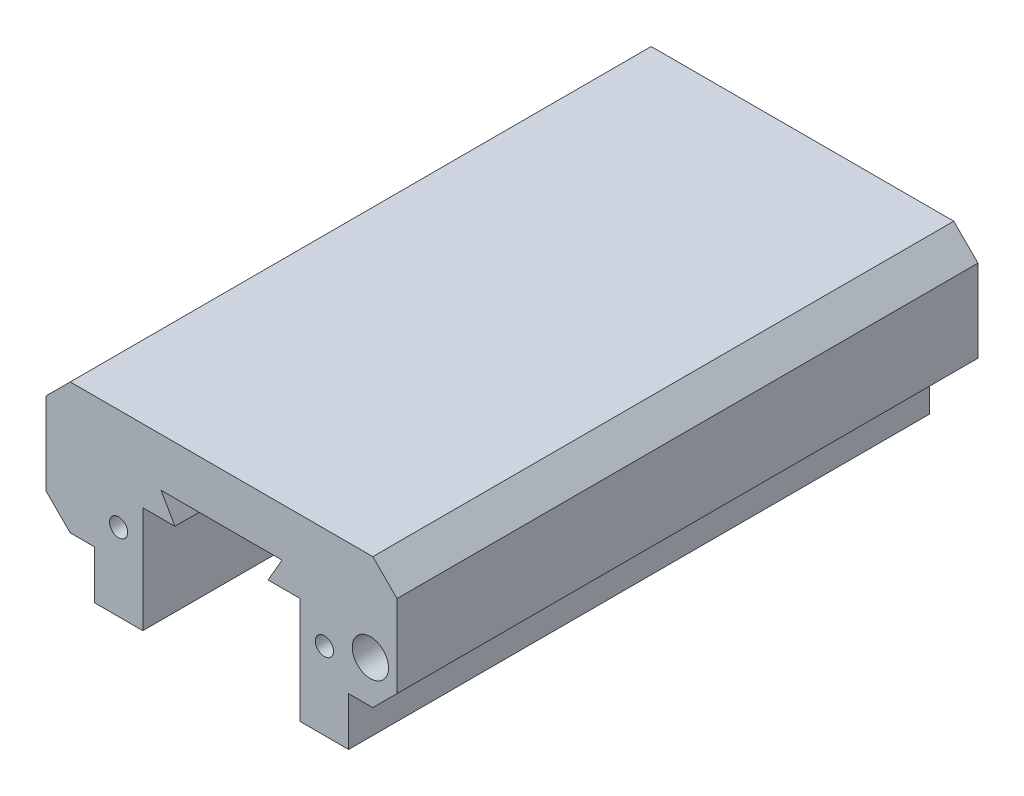
ISO-10303-21;
HEADER;
FILE_DESCRIPTION(('STEP AP214'),'2;1');
FILE_NAME('part.step','',(''),(''),'','','');
FILE_SCHEMA(('AUTOMOTIVE_DESIGN { 1 0 10303 214 1 1 1 1 }'));
ENDSEC;
DATA;
#1=APPLICATION_CONTEXT('core data for automotive mechanical design processes');
#2=APPLICATION_PROTOCOL_DEFINITION('international standard','automotive_design',2000,#1);
#3=PRODUCT_CONTEXT('',#1,'mechanical');
#4=PRODUCT('Part','Part','',(#3));
#5=PRODUCT_RELATED_PRODUCT_CATEGORY('part','',(#4));
#6=PRODUCT_DEFINITION_FORMATION('','',#4);
#7=PRODUCT_DEFINITION_CONTEXT('part definition',#1,'design');
#8=PRODUCT_DEFINITION('design','',#6,#7);
#9=PRODUCT_DEFINITION_SHAPE('','',#8);
#10=(LENGTH_UNIT() NAMED_UNIT(*) SI_UNIT(.MILLI.,.METRE.));
#11=(NAMED_UNIT(*) PLANE_ANGLE_UNIT() SI_UNIT($,.RADIAN.));
#12=(NAMED_UNIT(*) SI_UNIT($,.STERADIAN.) SOLID_ANGLE_UNIT());
#13=UNCERTAINTY_MEASURE_WITH_UNIT(LENGTH_MEASURE(1.E-05),#10,'distance_accuracy_value','');
#14=(GEOMETRIC_REPRESENTATION_CONTEXT(3) GLOBAL_UNCERTAINTY_ASSIGNED_CONTEXT((#13)) GLOBAL_UNIT_ASSIGNED_CONTEXT((#10,
#11,#12)) REPRESENTATION_CONTEXT('',''));
#15=CARTESIAN_POINT('',(0.,0.,0.));
#16=DIRECTION('',(0.,0.,1.));
#17=DIRECTION('',(1.,0.,0.));
#18=AXIS2_PLACEMENT_3D('',#15,#16,#17);
#19=CARTESIAN_POINT('',(0.,0.,6.05));
#20=DIRECTION('',(0.,0.,1.));
#21=DIRECTION('',(1.,0.,0.));
#22=AXIS2_PLACEMENT_3D('',#19,#20,#21);
#23=PLANE('',#22);
#24=CARTESIAN_POINT('',(2.125,-0.6,6.05));
#25=DIRECTION('',(0.,0.,1.));
#26=DIRECTION('',(1.,0.,0.));
#27=AXIS2_PLACEMENT_3D('',#24,#25,#26);
#28=CIRCLE('',#27,0.1875);
#29=CARTESIAN_POINT('',(2.3125,-0.6,6.05));
#30=VERTEX_POINT('',#29);
#31=EDGE_CURVE('E309',#30,#30,#28,.T.);
#32=ORIENTED_EDGE('',*,*,#31,.F.);
#33=EDGE_LOOP('',(#32));
#34=FACE_BOUND('',#33,.T.);
#35=CARTESIAN_POINT('',(-2.125,-0.6,6.05));
#36=DIRECTION('',(0.,0.,1.));
#37=DIRECTION('',(1.,0.,0.));
#38=AXIS2_PLACEMENT_3D('',#35,#36,#37);
#39=CIRCLE('',#38,0.1875);
#40=CARTESIAN_POINT('',(-1.9375,-0.6,6.05));
#41=VERTEX_POINT('',#40);
#42=EDGE_CURVE('E315',#41,#41,#39,.T.);
#43=ORIENTED_EDGE('',*,*,#42,.F.);
#44=EDGE_LOOP('',(#43));
#45=FACE_BOUND('',#44,.T.);
#46=CARTESIAN_POINT('',(3.075,-0.3315,6.05));
#47=DIRECTION('',(0.,0.,1.));
#48=DIRECTION('',(1.,0.,0.));
#49=AXIS2_PLACEMENT_3D('',#46,#47,#48);
#50=CIRCLE('',#49,0.375000000000001);
#51=CARTESIAN_POINT('',(3.45,-0.3315,6.05));
#52=VERTEX_POINT('',#51);
#53=EDGE_CURVE('E324',#52,#52,#50,.T.);
#54=ORIENTED_EDGE('',*,*,#53,.F.);
#55=EDGE_LOOP('',(#54));
#56=FACE_BOUND('',#55,.T.);
#57=DIRECTION('',(-1.,0.,0.));
#58=VECTOR('',#57,1.);
#59=CARTESIAN_POINT('',(0.,-1.2,6.05));
#60=LINE('',#59,#58);
#61=CARTESIAN_POINT('',(3.125,-1.2,6.05));
#62=VERTEX_POINT('',#61);
#63=CARTESIAN_POINT('',(2.625,-1.2,6.05));
#64=VERTEX_POINT('',#63);
#65=EDGE_CURVE('E351',#62,#64,#60,.T.);
#66=ORIENTED_EDGE('',*,*,#65,.F.);
#67=DIRECTION('',(-0.707106781186545,-0.70710678118655,0.));
#68=VECTOR('',#67,1.);
#69=CARTESIAN_POINT('',(2.16250000000001,-2.1625,6.05));
#70=LINE('',#69,#68);
#71=CARTESIAN_POINT('',(3.625,-0.7,6.05));
#72=VERTEX_POINT('',#71);
#73=EDGE_CURVE('E446',#62,#72,#70,.F.);
#74=ORIENTED_EDGE('',*,*,#73,.T.);
#75=DIRECTION('',(0.,-1.,0.));
#76=VECTOR('',#75,1.);
#77=CARTESIAN_POINT('',(3.625,0.,6.05));
#78=LINE('',#77,#76);
#79=CARTESIAN_POINT('',(3.625,1.,6.05));
#80=VERTEX_POINT('',#79);
#81=EDGE_CURVE('E353',#80,#72,#78,.T.);
#82=ORIENTED_EDGE('',*,*,#81,.F.);
#83=DIRECTION('',(0.707106781186549,-0.707106781186546,0.));
#84=VECTOR('',#83,1.);
#85=CARTESIAN_POINT('',(2.31249999999999,2.3125,6.05));
#86=LINE('',#85,#84);
#87=CARTESIAN_POINT('',(3.125,1.5,6.05));
#88=VERTEX_POINT('',#87);
#89=EDGE_CURVE('E440',#80,#88,#86,.F.);
#90=ORIENTED_EDGE('',*,*,#89,.T.);
#91=DIRECTION('',(1.,0.,0.));
#92=VECTOR('',#91,1.);
#93=CARTESIAN_POINT('',(0.,1.5,6.05));
#94=LINE('',#93,#92);
#95=CARTESIAN_POINT('',(-3.125,1.5,6.05));
#96=VERTEX_POINT('',#95);
#97=EDGE_CURVE('E356',#96,#88,#94,.T.);
#98=ORIENTED_EDGE('',*,*,#97,.F.);
#99=DIRECTION('',(-0.707106781186545,-0.70710678118655,0.));
#100=VECTOR('',#99,1.);
#101=CARTESIAN_POINT('',(-2.31250000000001,2.3125,6.05));
#102=LINE('',#101,#100);
#103=CARTESIAN_POINT('',(-3.625,1.,6.05));
#104=VERTEX_POINT('',#103);
#105=EDGE_CURVE('E442',#96,#104,#102,.T.);
#106=ORIENTED_EDGE('',*,*,#105,.T.);
#107=DIRECTION('',(0.,-1.,0.));
#108=VECTOR('',#107,1.);
#109=CARTESIAN_POINT('',(-3.625,0.,6.05));
#110=LINE('',#109,#108);
#111=CARTESIAN_POINT('',(-3.625,-0.700000000000002,6.05));
#112=VERTEX_POINT('',#111);
#113=EDGE_CURVE('E358',#104,#112,#110,.T.);
#114=ORIENTED_EDGE('',*,*,#113,.T.);
#115=DIRECTION('',(-0.707106781186549,0.707106781186546,0.));
#116=VECTOR('',#115,1.);
#117=CARTESIAN_POINT('',(-2.16249999999999,-2.1625,6.05));
#118=LINE('',#117,#116);
#119=CARTESIAN_POINT('',(-3.125,-1.2,6.05));
#120=VERTEX_POINT('',#119);
#121=EDGE_CURVE('E444',#112,#120,#118,.F.);
#122=ORIENTED_EDGE('',*,*,#121,.T.);
#123=DIRECTION('',(1.,0.,0.));
#124=VECTOR('',#123,1.);
#125=CARTESIAN_POINT('',(0.,-1.2,6.05));
#126=LINE('',#125,#124);
#127=CARTESIAN_POINT('',(-2.625,-1.2,6.05));
#128=VERTEX_POINT('',#127);
#129=EDGE_CURVE('E361',#120,#128,#126,.T.);
#130=ORIENTED_EDGE('',*,*,#129,.T.);
#131=DIRECTION('',(0.,-1.,0.));
#132=VECTOR('',#131,1.);
#133=CARTESIAN_POINT('',(-2.625,0.,6.05));
#134=LINE('',#133,#132);
#135=CARTESIAN_POINT('',(-2.625,-2.2,6.05));
#136=VERTEX_POINT('',#135);
#137=EDGE_CURVE('E363',#128,#136,#134,.T.);
#138=ORIENTED_EDGE('',*,*,#137,.T.);
#139=DIRECTION('',(-1.,0.,0.));
#140=VECTOR('',#139,1.);
#141=CARTESIAN_POINT('',(0.,-2.2,6.05));
#142=LINE('',#141,#140);
#143=CARTESIAN_POINT('',(-1.625,-2.2,6.05));
#144=VERTEX_POINT('',#143);
#145=EDGE_CURVE('E366',#144,#136,#142,.T.);
#146=ORIENTED_EDGE('',*,*,#145,.F.);
#147=DIRECTION('',(0.,-1.,0.));
#148=VECTOR('',#147,1.);
#149=CARTESIAN_POINT('',(-1.625,0.,6.05));
#150=LINE('',#149,#148);
#151=CARTESIAN_POINT('',(-1.625,0.,6.05));
#152=VERTEX_POINT('',#151);
#153=EDGE_CURVE('E369',#152,#144,#150,.T.);
#154=ORIENTED_EDGE('',*,*,#153,.F.);
#155=DIRECTION('',(1.,0.,0.));
#156=VECTOR('',#155,1.);
#157=CARTESIAN_POINT('',(0.,0.,6.05));
#158=LINE('',#157,#156);
#159=CARTESIAN_POINT('',(-0.961324865405191,0.,6.05));
#160=VERTEX_POINT('',#159);
#161=EDGE_CURVE('E327',#152,#160,#158,.T.);
#162=ORIENTED_EDGE('',*,*,#161,.T.);
#163=DIRECTION('',(0.5,-0.866025403784439,0.));
#164=VECTOR('',#163,1.);
#165=CARTESIAN_POINT('',(-0.720993649053893,-0.416265877365276,6.05));
#166=LINE('',#165,#164);
#167=CARTESIAN_POINT('',(-1.25,0.500000000000001,6.05));
#168=VERTEX_POINT('',#167);
#169=EDGE_CURVE('E330',#168,#160,#166,.T.);
#170=ORIENTED_EDGE('',*,*,#169,.F.);
#171=DIRECTION('',(1.,0.,0.));
#172=VECTOR('',#171,1.);
#173=CARTESIAN_POINT('',(0.,0.500000000000001,6.05));
#174=LINE('',#173,#172);
#175=CARTESIAN_POINT('',(1.25,0.5,6.05));
#176=VERTEX_POINT('',#175);
#177=EDGE_CURVE('E333',#168,#176,#174,.T.);
#178=ORIENTED_EDGE('',*,*,#177,.T.);
#179=DIRECTION('',(0.5,0.866025403784439,0.));
#180=VECTOR('',#179,1.);
#181=CARTESIAN_POINT('',(0.72099364905389,-0.416265877365274,6.05));
#182=LINE('',#181,#180);
#183=CARTESIAN_POINT('',(0.961324865405186,0.,6.05));
#184=VERTEX_POINT('',#183);
#185=EDGE_CURVE('E336',#184,#176,#182,.T.);
#186=ORIENTED_EDGE('',*,*,#185,.F.);
#187=DIRECTION('',(1.,0.,0.));
#188=VECTOR('',#187,1.);
#189=CARTESIAN_POINT('',(0.,0.,6.05));
#190=LINE('',#189,#188);
#191=CARTESIAN_POINT('',(1.625,0.,6.05));
#192=VERTEX_POINT('',#191);
#193=EDGE_CURVE('E339',#184,#192,#190,.T.);
#194=ORIENTED_EDGE('',*,*,#193,.T.);
#195=DIRECTION('',(0.,-1.,0.));
#196=VECTOR('',#195,1.);
#197=CARTESIAN_POINT('',(1.625,0.,6.05));
#198=LINE('',#197,#196);
#199=CARTESIAN_POINT('',(1.625,-2.2,6.05));
#200=VERTEX_POINT('',#199);
#201=EDGE_CURVE('E342',#192,#200,#198,.T.);
#202=ORIENTED_EDGE('',*,*,#201,.T.);
#203=DIRECTION('',(-1.,0.,0.));
#204=VECTOR('',#203,1.);
#205=CARTESIAN_POINT('',(0.,-2.2,6.05));
#206=LINE('',#205,#204);
#207=CARTESIAN_POINT('',(2.625,-2.2,6.05));
#208=VERTEX_POINT('',#207);
#209=EDGE_CURVE('E345',#208,#200,#206,.T.);
#210=ORIENTED_EDGE('',*,*,#209,.F.);
#211=DIRECTION('',(0.,-1.,0.));
#212=VECTOR('',#211,1.);
#213=CARTESIAN_POINT('',(2.625,0.,6.05));
#214=LINE('',#213,#212);
#215=EDGE_CURVE('E348',#64,#208,#214,.T.);
#216=ORIENTED_EDGE('',*,*,#215,.F.);
#217=EDGE_LOOP('',(#66,#74,#82,#90,#98,#106,#114,#122,#130,#138,#146,#154,#162,#170,#178,#186,
#194,#202,#210,#216));
#218=FACE_BOUND('',#217,.T.);
#219=ADVANCED_FACE('F140',(#34,#45,#56,#218),#23,.T.);
#220=CARTESIAN_POINT('',(0.,0.,-5.95));
#221=DIRECTION('',(0.,-1.,0.));
#222=DIRECTION('',(1.,0.,0.));
#223=AXIS2_PLACEMENT_3D('',#220,#221,#222);
#224=PLANE('',#223);
#225=DIRECTION('',(0.,0.,1.));
#226=VECTOR('',#225,1.);
#227=CARTESIAN_POINT('',(-0.961324865405191,0.,-5.95));
#228=LINE('',#227,#226);
#229=CARTESIAN_POINT('',(-0.961324865405191,0.,-5.95));
#230=VERTEX_POINT('',#229);
#231=EDGE_CURVE('E411',#230,#160,#228,.T.);
#232=ORIENTED_EDGE('',*,*,#231,.T.);
#233=ORIENTED_EDGE('',*,*,#161,.F.);
#234=DIRECTION('',(0.,0.,1.));
#235=VECTOR('',#234,1.);
#236=CARTESIAN_POINT('',(-1.625,0.,-5.95));
#237=LINE('',#236,#235);
#238=CARTESIAN_POINT('',(-1.625,0.,-5.95));
#239=VERTEX_POINT('',#238);
#240=EDGE_CURVE('E412',#239,#152,#237,.T.);
#241=ORIENTED_EDGE('',*,*,#240,.F.);
#242=DIRECTION('',(1.,0.,0.));
#243=VECTOR('',#242,1.);
#244=CARTESIAN_POINT('',(0.,0.,-5.95));
#245=LINE('',#244,#243);
#246=EDGE_CURVE('E372',#239,#230,#245,.T.);
#247=ORIENTED_EDGE('',*,*,#246,.T.);
#248=EDGE_LOOP('',(#232,#233,#241,#247));
#249=FACE_BOUND('',#248,.T.);
#250=ADVANCED_FACE('F540',(#249),#224,.T.);
#251=CARTESIAN_POINT('',(-1.625,0.,-5.95));
#252=DIRECTION('',(-1.,0.,0.));
#253=DIRECTION('',(0.,-1.,0.));
#254=AXIS2_PLACEMENT_3D('',#251,#252,#253);
#255=PLANE('',#254);
#256=ORIENTED_EDGE('',*,*,#240,.T.);
#257=ORIENTED_EDGE('',*,*,#153,.T.);
#258=DIRECTION('',(0.,0.,1.));
#259=VECTOR('',#258,1.);
#260=CARTESIAN_POINT('',(-1.625,-2.2,-5.95));
#261=LINE('',#260,#259);
#262=CARTESIAN_POINT('',(-1.625,-2.2,-5.95));
#263=VERTEX_POINT('',#262);
#264=EDGE_CURVE('E415',#263,#144,#261,.T.);
#265=ORIENTED_EDGE('',*,*,#264,.F.);
#266=DIRECTION('',(0.,-1.,0.));
#267=VECTOR('',#266,1.);
#268=CARTESIAN_POINT('',(-1.625,0.,-5.95));
#269=LINE('',#268,#267);
#270=EDGE_CURVE('E409',#239,#263,#269,.T.);
#271=ORIENTED_EDGE('',*,*,#270,.F.);
#272=EDGE_LOOP('',(#256,#257,#265,#271));
#273=FACE_BOUND('',#272,.T.);
#274=ADVANCED_FACE('F546',(#273),#255,.F.);
#275=CARTESIAN_POINT('',(0.,-2.2,-5.95));
#276=DIRECTION('',(0.,1.,0.));
#277=DIRECTION('',(-1.,0.,0.));
#278=AXIS2_PLACEMENT_3D('',#275,#276,#277);
#279=PLANE('',#278);
#280=ORIENTED_EDGE('',*,*,#264,.T.);
#281=ORIENTED_EDGE('',*,*,#145,.T.);
#282=DIRECTION('',(0.,0.,1.));
#283=VECTOR('',#282,1.);
#284=CARTESIAN_POINT('',(-2.625,-2.2,-5.95));
#285=LINE('',#284,#283);
#286=CARTESIAN_POINT('',(-2.625,-2.2,-5.95));
#287=VERTEX_POINT('',#286);
#288=EDGE_CURVE('E417',#287,#136,#285,.T.);
#289=ORIENTED_EDGE('',*,*,#288,.F.);
#290=DIRECTION('',(-1.,0.,0.));
#291=VECTOR('',#290,1.);
#292=CARTESIAN_POINT('',(0.,-2.2,-5.95));
#293=LINE('',#292,#291);
#294=EDGE_CURVE('E407',#263,#287,#293,.T.);
#295=ORIENTED_EDGE('',*,*,#294,.F.);
#296=EDGE_LOOP('',(#280,#281,#289,#295));
#297=FACE_BOUND('',#296,.T.);
#298=ADVANCED_FACE('F550',(#297),#279,.F.);
#299=CARTESIAN_POINT('',(-2.625,0.,-5.95));
#300=DIRECTION('',(-1.,0.,0.));
#301=DIRECTION('',(0.,0.,1.));
#302=AXIS2_PLACEMENT_3D('',#299,#300,#301);
#303=PLANE('',#302);
#304=ORIENTED_EDGE('',*,*,#288,.T.);
#305=ORIENTED_EDGE('',*,*,#137,.F.);
#306=DIRECTION('',(0.,0.,1.));
#307=VECTOR('',#306,1.);
#308=CARTESIAN_POINT('',(-2.625,-1.2,-5.95));
#309=LINE('',#308,#307);
#310=CARTESIAN_POINT('',(-2.625,-1.2,-5.95));
#311=VERTEX_POINT('',#310);
#312=EDGE_CURVE('E419',#311,#128,#309,.T.);
#313=ORIENTED_EDGE('',*,*,#312,.F.);
#314=DIRECTION('',(0.,-1.,0.));
#315=VECTOR('',#314,1.);
#316=CARTESIAN_POINT('',(-2.625,0.,-5.95));
#317=LINE('',#316,#315);
#318=EDGE_CURVE('E404',#311,#287,#317,.T.);
#319=ORIENTED_EDGE('',*,*,#318,.T.);
#320=EDGE_LOOP('',(#304,#305,#313,#319));
#321=FACE_BOUND('',#320,.T.);
#322=ADVANCED_FACE('F553',(#321),#303,.T.);
#323=CARTESIAN_POINT('',(0.,-1.2,-5.95));
#324=DIRECTION('',(0.,-1.,0.));
#325=DIRECTION('',(0.,0.,-1.));
#326=AXIS2_PLACEMENT_3D('',#323,#324,#325);
#327=PLANE('',#326);
#328=ORIENTED_EDGE('',*,*,#129,.F.);
#329=DIRECTION('',(0.,0.,-1.));
#330=VECTOR('',#329,1.);
#331=CARTESIAN_POINT('',(-3.125,-1.2,-5.95));
#332=LINE('',#331,#330);
#333=CARTESIAN_POINT('',(-3.125,-1.2,-5.95));
#334=VERTEX_POINT('',#333);
#335=EDGE_CURVE('E465',#120,#334,#332,.T.);
#336=ORIENTED_EDGE('',*,*,#335,.T.);
#337=DIRECTION('',(1.,0.,0.));
#338=VECTOR('',#337,1.);
#339=CARTESIAN_POINT('',(0.,-1.2,-5.95));
#340=LINE('',#339,#338);
#341=EDGE_CURVE('E402',#334,#311,#340,.T.);
#342=ORIENTED_EDGE('',*,*,#341,.T.);
#343=ORIENTED_EDGE('',*,*,#312,.T.);
#344=EDGE_LOOP('',(#328,#336,#342,#343));
#345=FACE_BOUND('',#344,.T.);
#346=ADVANCED_FACE('F470',(#345),#327,.T.);
#347=CARTESIAN_POINT('',(-3.625,0.,-5.95));
#348=DIRECTION('',(-1.,0.,0.));
#349=DIRECTION('',(0.,-1.,0.));
#350=AXIS2_PLACEMENT_3D('',#347,#348,#349);
#351=PLANE('',#350);
#352=DIRECTION('',(0.,-1.,0.));
#353=VECTOR('',#352,1.);
#354=CARTESIAN_POINT('',(-3.625,0.,-5.95));
#355=LINE('',#354,#353);
#356=CARTESIAN_POINT('',(-3.625,1.,-5.95));
#357=VERTEX_POINT('',#356);
#358=CARTESIAN_POINT('',(-3.625,-0.700000000000002,-5.95));
#359=VERTEX_POINT('',#358);
#360=EDGE_CURVE('E399',#357,#359,#355,.T.);
#361=ORIENTED_EDGE('',*,*,#360,.T.);
#362=DIRECTION('',(0.,0.,1.));
#363=VECTOR('',#362,1.);
#364=CARTESIAN_POINT('',(-3.625,-0.700000000000002,-5.95));
#365=LINE('',#364,#363);
#366=EDGE_CURVE('E462',#359,#112,#365,.T.);
#367=ORIENTED_EDGE('',*,*,#366,.T.);
#368=ORIENTED_EDGE('',*,*,#113,.F.);
#369=DIRECTION('',(0.,0.,-1.));
#370=VECTOR('',#369,1.);
#371=CARTESIAN_POINT('',(-3.625,1.,-5.95));
#372=LINE('',#371,#370);
#373=EDGE_CURVE('E460',#104,#357,#372,.T.);
#374=ORIENTED_EDGE('',*,*,#373,.T.);
#375=EDGE_LOOP('',(#361,#367,#368,#374));
#376=FACE_BOUND('',#375,.T.);
#377=ADVANCED_FACE('F480',(#376),#351,.T.);
#378=CARTESIAN_POINT('',(0.,1.5,-5.95));
#379=DIRECTION('',(0.,-1.,0.));
#380=DIRECTION('',(1.,0.,0.));
#381=AXIS2_PLACEMENT_3D('',#378,#379,#380);
#382=PLANE('',#381);
#383=DIRECTION('',(1.,0.,0.));
#384=VECTOR('',#383,1.);
#385=CARTESIAN_POINT('',(0.,1.5,-5.95));
#386=LINE('',#385,#384);
#387=CARTESIAN_POINT('',(-3.125,1.5,-5.95));
#388=VERTEX_POINT('',#387);
#389=CARTESIAN_POINT('',(3.125,1.5,-5.95));
#390=VERTEX_POINT('',#389);
#391=EDGE_CURVE('E397',#388,#390,#386,.T.);
#392=ORIENTED_EDGE('',*,*,#391,.F.);
#393=DIRECTION('',(0.,0.,1.));
#394=VECTOR('',#393,1.);
#395=CARTESIAN_POINT('',(-3.125,1.5,6.05));
#396=LINE('',#395,#394);
#397=EDGE_CURVE('E12',#388,#96,#396,.T.);
#398=ORIENTED_EDGE('',*,*,#397,.T.);
#399=ORIENTED_EDGE('',*,*,#97,.T.);
#400=DIRECTION('',(0.,0.,-1.));
#401=VECTOR('',#400,1.);
#402=CARTESIAN_POINT('',(3.125,1.5,-5.95));
#403=LINE('',#402,#401);
#404=EDGE_CURVE('E148',#88,#390,#403,.T.);
#405=ORIENTED_EDGE('',*,*,#404,.T.);
#406=EDGE_LOOP('',(#392,#398,#399,#405));
#407=FACE_BOUND('',#406,.T.);
#408=ADVANCED_FACE('F488',(#407),#382,.F.);
#409=CARTESIAN_POINT('',(3.625,0.,-5.95));
#410=DIRECTION('',(-1.,0.,0.));
#411=DIRECTION('',(0.,-1.,0.));
#412=AXIS2_PLACEMENT_3D('',#409,#410,#411);
#413=PLANE('',#412);
#414=ORIENTED_EDGE('',*,*,#81,.T.);
#415=DIRECTION('',(0.,0.,-1.));
#416=VECTOR('',#415,1.);
#417=CARTESIAN_POINT('',(3.625,-0.7,-5.95));
#418=LINE('',#417,#416);
#419=CARTESIAN_POINT('',(3.625,-0.7,-5.95));
#420=VERTEX_POINT('',#419);
#421=EDGE_CURVE('E451',#72,#420,#418,.T.);
#422=ORIENTED_EDGE('',*,*,#421,.T.);
#423=DIRECTION('',(0.,-1.,0.));
#424=VECTOR('',#423,1.);
#425=CARTESIAN_POINT('',(3.625,0.,-5.95));
#426=LINE('',#425,#424);
#427=CARTESIAN_POINT('',(3.625,1.,-5.95));
#428=VERTEX_POINT('',#427);
#429=EDGE_CURVE('E394',#428,#420,#426,.T.);
#430=ORIENTED_EDGE('',*,*,#429,.F.);
#431=DIRECTION('',(0.,0.,1.));
#432=VECTOR('',#431,1.);
#433=CARTESIAN_POINT('',(3.625,1.,-5.95));
#434=LINE('',#433,#432);
#435=EDGE_CURVE('E448',#428,#80,#434,.T.);
#436=ORIENTED_EDGE('',*,*,#435,.T.);
#437=EDGE_LOOP('',(#414,#422,#430,#436));
#438=FACE_BOUND('',#437,.T.);
#439=ADVANCED_FACE('F495',(#438),#413,.F.);
#440=CARTESIAN_POINT('',(0.,-1.2,-5.95));
#441=DIRECTION('',(0.,1.,0.));
#442=DIRECTION('',(0.,0.,1.));
#443=AXIS2_PLACEMENT_3D('',#440,#441,#442);
#444=PLANE('',#443);
#445=DIRECTION('',(-1.,0.,0.));
#446=VECTOR('',#445,1.);
#447=CARTESIAN_POINT('',(0.,-1.2,-5.95));
#448=LINE('',#447,#446);
#449=CARTESIAN_POINT('',(3.125,-1.2,-5.95));
#450=VERTEX_POINT('',#449);
#451=CARTESIAN_POINT('',(2.625,-1.2,-5.95));
#452=VERTEX_POINT('',#451);
#453=EDGE_CURVE('E392',#450,#452,#448,.T.);
#454=ORIENTED_EDGE('',*,*,#453,.F.);
#455=DIRECTION('',(0.,0.,1.));
#456=VECTOR('',#455,1.);
#457=CARTESIAN_POINT('',(3.125,-1.2,-5.95));
#458=LINE('',#457,#456);
#459=EDGE_CURVE('E414',#450,#62,#458,.T.);
#460=ORIENTED_EDGE('',*,*,#459,.T.);
#461=ORIENTED_EDGE('',*,*,#65,.T.);
#462=DIRECTION('',(0.,0.,1.));
#463=VECTOR('',#462,1.);
#464=CARTESIAN_POINT('',(2.625,-1.2,-5.95));
#465=LINE('',#464,#463);
#466=EDGE_CURVE('E422',#452,#64,#465,.T.);
#467=ORIENTED_EDGE('',*,*,#466,.F.);
#468=EDGE_LOOP('',(#454,#460,#461,#467));
#469=FACE_BOUND('',#468,.T.);
#470=ADVANCED_FACE('F504',(#469),#444,.F.);
#471=CARTESIAN_POINT('',(2.625,0.,-5.95));
#472=DIRECTION('',(-1.,0.,0.));
#473=DIRECTION('',(0.,0.,1.));
#474=AXIS2_PLACEMENT_3D('',#471,#472,#473);
#475=PLANE('',#474);
#476=ORIENTED_EDGE('',*,*,#466,.T.);
#477=ORIENTED_EDGE('',*,*,#215,.T.);
#478=DIRECTION('',(0.,0.,1.));
#479=VECTOR('',#478,1.);
#480=CARTESIAN_POINT('',(2.625,-2.2,-5.95));
#481=LINE('',#480,#479);
#482=CARTESIAN_POINT('',(2.625,-2.2,-5.95));
#483=VERTEX_POINT('',#482);
#484=EDGE_CURVE('E425',#483,#208,#481,.T.);
#485=ORIENTED_EDGE('',*,*,#484,.F.);
#486=DIRECTION('',(0.,-1.,0.));
#487=VECTOR('',#486,1.);
#488=CARTESIAN_POINT('',(2.625,0.,-5.95));
#489=LINE('',#488,#487);
#490=EDGE_CURVE('E390',#452,#483,#489,.T.);
#491=ORIENTED_EDGE('',*,*,#490,.F.);
#492=EDGE_LOOP('',(#476,#477,#485,#491));
#493=FACE_BOUND('',#492,.T.);
#494=ADVANCED_FACE('F512',(#493),#475,.F.);
#495=CARTESIAN_POINT('',(0.,-2.2,-5.95));
#496=DIRECTION('',(0.,1.,0.));
#497=DIRECTION('',(-1.,0.,0.));
#498=AXIS2_PLACEMENT_3D('',#495,#496,#497);
#499=PLANE('',#498);
#500=ORIENTED_EDGE('',*,*,#484,.T.);
#501=ORIENTED_EDGE('',*,*,#209,.T.);
#502=DIRECTION('',(0.,0.,1.));
#503=VECTOR('',#502,1.);
#504=CARTESIAN_POINT('',(1.625,-2.2,-5.95));
#505=LINE('',#504,#503);
#506=CARTESIAN_POINT('',(1.625,-2.2,-5.95));
#507=VERTEX_POINT('',#506);
#508=EDGE_CURVE('E427',#507,#200,#505,.T.);
#509=ORIENTED_EDGE('',*,*,#508,.F.);
#510=DIRECTION('',(-1.,0.,0.));
#511=VECTOR('',#510,1.);
#512=CARTESIAN_POINT('',(0.,-2.2,-5.95));
#513=LINE('',#512,#511);
#514=EDGE_CURVE('E388',#483,#507,#513,.T.);
#515=ORIENTED_EDGE('',*,*,#514,.F.);
#516=EDGE_LOOP('',(#500,#501,#509,#515));
#517=FACE_BOUND('',#516,.T.);
#518=ADVANCED_FACE('F515',(#517),#499,.F.);
#519=CARTESIAN_POINT('',(1.625,0.,-5.95));
#520=DIRECTION('',(-1.,0.,0.));
#521=DIRECTION('',(0.,-1.,0.));
#522=AXIS2_PLACEMENT_3D('',#519,#520,#521);
#523=PLANE('',#522);
#524=ORIENTED_EDGE('',*,*,#508,.T.);
#525=ORIENTED_EDGE('',*,*,#201,.F.);
#526=DIRECTION('',(0.,0.,1.));
#527=VECTOR('',#526,1.);
#528=CARTESIAN_POINT('',(1.625,0.,-5.95));
#529=LINE('',#528,#527);
#530=CARTESIAN_POINT('',(1.625,0.,-5.95));
#531=VERTEX_POINT('',#530);
#532=EDGE_CURVE('E429',#531,#192,#529,.T.);
#533=ORIENTED_EDGE('',*,*,#532,.F.);
#534=DIRECTION('',(0.,-1.,0.));
#535=VECTOR('',#534,1.);
#536=CARTESIAN_POINT('',(1.625,0.,-5.95));
#537=LINE('',#536,#535);
#538=EDGE_CURVE('E385',#531,#507,#537,.T.);
#539=ORIENTED_EDGE('',*,*,#538,.T.);
#540=EDGE_LOOP('',(#524,#525,#533,#539));
#541=FACE_BOUND('',#540,.T.);
#542=ADVANCED_FACE('F518',(#541),#523,.T.);
#543=CARTESIAN_POINT('',(0.,0.,-5.95));
#544=DIRECTION('',(0.,-1.,0.));
#545=DIRECTION('',(1.,0.,0.));
#546=AXIS2_PLACEMENT_3D('',#543,#544,#545);
#547=PLANE('',#546);
#548=ORIENTED_EDGE('',*,*,#532,.T.);
#549=ORIENTED_EDGE('',*,*,#193,.F.);
#550=DIRECTION('',(0.,0.,1.));
#551=VECTOR('',#550,1.);
#552=CARTESIAN_POINT('',(0.961324865405186,0.,-5.95));
#553=LINE('',#552,#551);
#554=CARTESIAN_POINT('',(0.961324865405186,0.,-5.95));
#555=VERTEX_POINT('',#554);
#556=EDGE_CURVE('E431',#555,#184,#553,.T.);
#557=ORIENTED_EDGE('',*,*,#556,.F.);
#558=DIRECTION('',(1.,0.,0.));
#559=VECTOR('',#558,1.);
#560=CARTESIAN_POINT('',(0.,0.,-5.95));
#561=LINE('',#560,#559);
#562=EDGE_CURVE('E382',#555,#531,#561,.T.);
#563=ORIENTED_EDGE('',*,*,#562,.T.);
#564=EDGE_LOOP('',(#548,#549,#557,#563));
#565=FACE_BOUND('',#564,.T.);
#566=ADVANCED_FACE('F521',(#565),#547,.T.);
#567=CARTESIAN_POINT('',(0.72099364905389,-0.416265877365274,-5.95));
#568=DIRECTION('',(0.866025403784439,-0.5,0.));
#569=DIRECTION('',(0.5,0.866025403784439,0.));
#570=AXIS2_PLACEMENT_3D('',#567,#568,#569);
#571=PLANE('',#570);
#572=ORIENTED_EDGE('',*,*,#556,.T.);
#573=ORIENTED_EDGE('',*,*,#185,.T.);
#574=DIRECTION('',(0.,0.,1.));
#575=VECTOR('',#574,1.);
#576=CARTESIAN_POINT('',(1.25,0.5,-5.95));
#577=LINE('',#576,#575);
#578=CARTESIAN_POINT('',(1.25,0.5,-5.95));
#579=VERTEX_POINT('',#578);
#580=EDGE_CURVE('E433',#579,#176,#577,.T.);
#581=ORIENTED_EDGE('',*,*,#580,.F.);
#582=DIRECTION('',(0.5,0.866025403784439,0.));
#583=VECTOR('',#582,1.);
#584=CARTESIAN_POINT('',(0.72099364905389,-0.416265877365274,-5.95));
#585=LINE('',#584,#583);
#586=EDGE_CURVE('E380',#555,#579,#585,.T.);
#587=ORIENTED_EDGE('',*,*,#586,.F.);
#588=EDGE_LOOP('',(#572,#573,#581,#587));
#589=FACE_BOUND('',#588,.T.);
#590=ADVANCED_FACE('F527',(#589),#571,.F.);
#591=CARTESIAN_POINT('',(0.,0.500000000000001,-5.95));
#592=DIRECTION('',(0.,-1.,0.));
#593=DIRECTION('',(1.,0.,0.));
#594=AXIS2_PLACEMENT_3D('',#591,#592,#593);
#595=PLANE('',#594);
#596=ORIENTED_EDGE('',*,*,#580,.T.);
#597=ORIENTED_EDGE('',*,*,#177,.F.);
#598=DIRECTION('',(0.,0.,1.));
#599=VECTOR('',#598,1.);
#600=CARTESIAN_POINT('',(-1.25,0.500000000000001,-5.95));
#601=LINE('',#600,#599);
#602=CARTESIAN_POINT('',(-1.25,0.500000000000001,-5.95));
#603=VERTEX_POINT('',#602);
#604=EDGE_CURVE('E435',#603,#168,#601,.T.);
#605=ORIENTED_EDGE('',*,*,#604,.F.);
#606=DIRECTION('',(1.,0.,0.));
#607=VECTOR('',#606,1.);
#608=CARTESIAN_POINT('',(0.,0.500000000000001,-5.95));
#609=LINE('',#608,#607);
#610=EDGE_CURVE('E377',#603,#579,#609,.T.);
#611=ORIENTED_EDGE('',*,*,#610,.T.);
#612=EDGE_LOOP('',(#596,#597,#605,#611));
#613=FACE_BOUND('',#612,.T.);
#614=ADVANCED_FACE('F533',(#613),#595,.T.);
#615=CARTESIAN_POINT('',(-0.720993649053893,-0.416265877365276,-5.95));
#616=DIRECTION('',(-0.866025403784439,-0.5,0.));
#617=DIRECTION('',(0.5,-0.866025403784439,0.));
#618=AXIS2_PLACEMENT_3D('',#615,#616,#617);
#619=PLANE('',#618);
#620=ORIENTED_EDGE('',*,*,#604,.T.);
#621=ORIENTED_EDGE('',*,*,#169,.T.);
#622=ORIENTED_EDGE('',*,*,#231,.F.);
#623=DIRECTION('',(0.5,-0.866025403784439,0.));
#624=VECTOR('',#623,1.);
#625=CARTESIAN_POINT('',(-0.720993649053893,-0.416265877365276,-5.95));
#626=LINE('',#625,#624);
#627=EDGE_CURVE('E375',#603,#230,#626,.T.);
#628=ORIENTED_EDGE('',*,*,#627,.F.);
#629=EDGE_LOOP('',(#620,#621,#622,#628));
#630=FACE_BOUND('',#629,.T.);
#631=ADVANCED_FACE('F537',(#630),#619,.F.);
#632=CARTESIAN_POINT('',(0.,0.,-5.95));
#633=DIRECTION('',(0.,0.,1.));
#634=DIRECTION('',(1.,0.,0.));
#635=AXIS2_PLACEMENT_3D('',#632,#633,#634);
#636=PLANE('',#635);
#637=CARTESIAN_POINT('',(2.125,-0.6,-5.95));
#638=DIRECTION('',(0.,0.,-1.));
#639=DIRECTION('',(-1.,0.,0.));
#640=AXIS2_PLACEMENT_3D('',#637,#638,#639);
#641=CIRCLE('',#640,0.1875);
#642=CARTESIAN_POINT('',(1.9375,-0.6,-5.95));
#643=VERTEX_POINT('',#642);
#644=EDGE_CURVE('E299',#643,#643,#641,.T.);
#645=ORIENTED_EDGE('',*,*,#644,.F.);
#646=EDGE_LOOP('',(#645));
#647=FACE_BOUND('',#646,.T.);
#648=CARTESIAN_POINT('',(-2.125,-0.6,-5.95));
#649=DIRECTION('',(0.,0.,-1.));
#650=DIRECTION('',(-1.,0.,0.));
#651=AXIS2_PLACEMENT_3D('',#648,#649,#650);
#652=CIRCLE('',#651,0.1875);
#653=CARTESIAN_POINT('',(-2.3125,-0.6,-5.95));
#654=VERTEX_POINT('',#653);
#655=EDGE_CURVE('E298',#654,#654,#652,.T.);
#656=ORIENTED_EDGE('',*,*,#655,.F.);
#657=EDGE_LOOP('',(#656));
#658=FACE_BOUND('',#657,.T.);
#659=ORIENTED_EDGE('',*,*,#429,.T.);
#660=DIRECTION('',(0.707106781186545,0.70710678118655,0.));
#661=VECTOR('',#660,1.);
#662=CARTESIAN_POINT('',(3.125,-1.2,-5.95));
#663=LINE('',#662,#661);
#664=EDGE_CURVE('E458',#420,#450,#663,.F.);
#665=ORIENTED_EDGE('',*,*,#664,.T.);
#666=ORIENTED_EDGE('',*,*,#453,.T.);
#667=ORIENTED_EDGE('',*,*,#490,.T.);
#668=ORIENTED_EDGE('',*,*,#514,.T.);
#669=ORIENTED_EDGE('',*,*,#538,.F.);
#670=ORIENTED_EDGE('',*,*,#562,.F.);
#671=ORIENTED_EDGE('',*,*,#586,.T.);
#672=ORIENTED_EDGE('',*,*,#610,.F.);
#673=ORIENTED_EDGE('',*,*,#627,.T.);
#674=ORIENTED_EDGE('',*,*,#246,.F.);
#675=ORIENTED_EDGE('',*,*,#270,.T.);
#676=ORIENTED_EDGE('',*,*,#294,.T.);
#677=ORIENTED_EDGE('',*,*,#318,.F.);
#678=ORIENTED_EDGE('',*,*,#341,.F.);
#679=DIRECTION('',(0.707106781186549,-0.707106781186546,0.));
#680=VECTOR('',#679,1.);
#681=CARTESIAN_POINT('',(-3.625,-0.700000000000002,-5.95));
#682=LINE('',#681,#680);
#683=EDGE_CURVE('E456',#334,#359,#682,.F.);
#684=ORIENTED_EDGE('',*,*,#683,.T.);
#685=ORIENTED_EDGE('',*,*,#360,.F.);
#686=DIRECTION('',(0.707106781186545,0.70710678118655,0.));
#687=VECTOR('',#686,1.);
#688=CARTESIAN_POINT('',(-3.125,1.5,-5.95));
#689=LINE('',#688,#687);
#690=EDGE_CURVE('E161',#357,#388,#689,.T.);
#691=ORIENTED_EDGE('',*,*,#690,.T.);
#692=ORIENTED_EDGE('',*,*,#391,.T.);
#693=DIRECTION('',(-0.707106781186549,0.707106781186546,0.));
#694=VECTOR('',#693,1.);
#695=CARTESIAN_POINT('',(3.625,1.,-5.95));
#696=LINE('',#695,#694);
#697=EDGE_CURVE('E453',#390,#428,#696,.F.);
#698=ORIENTED_EDGE('',*,*,#697,.T.);
#699=EDGE_LOOP('',(#659,#665,#666,#667,#668,#669,#670,#671,#672,#673,#674,#675,#676,#677,#678,
#684,#685,#691,#692,#698));
#700=FACE_BOUND('',#699,.T.);
#701=ADVANCED_FACE('F475',(#647,#658,#700),#636,.F.);
#702=CARTESIAN_POINT('',(3.075,-0.3315,6.051));
#703=DIRECTION('',(0.,0.,-1.));
#704=DIRECTION('',(-1.,0.,0.));
#705=AXIS2_PLACEMENT_3D('',#702,#703,#704);
#706=CYLINDRICAL_SURFACE('',#705,0.375000000000001);
#707=ORIENTED_EDGE('',*,*,#53,.T.);
#708=EDGE_LOOP('',(#707));
#709=FACE_BOUND('',#708,.T.);
#710=CARTESIAN_POINT('',(3.075,-0.3315,-4.));
#711=DIRECTION('',(0.,0.,1.));
#712=DIRECTION('',(1.,0.,0.));
#713=AXIS2_PLACEMENT_3D('',#710,#711,#712);
#714=CIRCLE('',#713,0.375000000000001);
#715=CARTESIAN_POINT('',(3.45,-0.3315,-4.));
#716=VERTEX_POINT('',#715);
#717=EDGE_CURVE('E321',#716,#716,#714,.T.);
#718=ORIENTED_EDGE('',*,*,#717,.F.);
#719=EDGE_LOOP('',(#718));
#720=FACE_BOUND('',#719,.T.);
#721=ADVANCED_FACE('F573',(#709,#720),#706,.F.);
#722=CARTESIAN_POINT('',(3.075,-0.3315,-4.));
#723=DIRECTION('',(0.,0.,1.));
#724=DIRECTION('',(1.,0.,0.));
#725=AXIS2_PLACEMENT_3D('',#722,#723,#724);
#726=PLANE('',#725);
#727=ORIENTED_EDGE('',*,*,#717,.T.);
#728=EDGE_LOOP('',(#727));
#729=FACE_BOUND('',#728,.T.);
#730=ADVANCED_FACE('F665',(#729),#726,.T.);
#731=CARTESIAN_POINT('',(-2.125,-0.6,4.42));
#732=DIRECTION('',(0.,0.,1.));
#733=DIRECTION('',(1.,0.,0.));
#734=AXIS2_PLACEMENT_3D('',#731,#732,#733);
#735=CONICAL_SURFACE('',#734,0.1875,1.02974425867665);
#736=CARTESIAN_POINT('',(-2.125,-0.6,4.30733863393233));
#737=VERTEX_POINT('',#736);
#738=VERTEX_LOOP('',#737);
#739=FACE_BOUND('',#738,.T.);
#740=CARTESIAN_POINT('',(-2.125,-0.6,4.42));
#741=DIRECTION('',(0.,0.,1.));
#742=DIRECTION('',(1.,0.,0.));
#743=AXIS2_PLACEMENT_3D('',#740,#741,#742);
#744=CIRCLE('',#743,0.1875);
#745=CARTESIAN_POINT('',(-1.9375,-0.6,4.42));
#746=VERTEX_POINT('',#745);
#747=EDGE_CURVE('E318',#746,#746,#744,.T.);
#748=ORIENTED_EDGE('',*,*,#747,.T.);
#749=EDGE_LOOP('',(#748));
#750=FACE_BOUND('',#749,.T.);
#751=ADVANCED_FACE('F675',(#739,#750),#735,.F.);
#752=CARTESIAN_POINT('',(-2.125,-0.6,6.05));
#753=DIRECTION('',(0.,0.,1.));
#754=DIRECTION('',(1.,0.,0.));
#755=AXIS2_PLACEMENT_3D('',#752,#753,#754);
#756=CYLINDRICAL_SURFACE('',#755,0.1875);
#757=ORIENTED_EDGE('',*,*,#747,.F.);
#758=EDGE_LOOP('',(#757));
#759=FACE_BOUND('',#758,.T.);
#760=ORIENTED_EDGE('',*,*,#42,.T.);
#761=EDGE_LOOP('',(#760));
#762=FACE_BOUND('',#761,.T.);
#763=ADVANCED_FACE('F684',(#759,#762),#756,.F.);
#764=CARTESIAN_POINT('',(2.125,-0.6,4.42));
#765=DIRECTION('',(0.,0.,1.));
#766=DIRECTION('',(1.,0.,0.));
#767=AXIS2_PLACEMENT_3D('',#764,#765,#766);
#768=CONICAL_SURFACE('',#767,0.1875,1.02974425867665);
#769=CARTESIAN_POINT('',(2.125,-0.6,4.30733863393233));
#770=VERTEX_POINT('',#769);
#771=VERTEX_LOOP('',#770);
#772=FACE_BOUND('',#771,.T.);
#773=CARTESIAN_POINT('',(2.125,-0.6,4.42));
#774=DIRECTION('',(0.,0.,1.));
#775=DIRECTION('',(1.,0.,0.));
#776=AXIS2_PLACEMENT_3D('',#773,#774,#775);
#777=CIRCLE('',#776,0.1875);
#778=CARTESIAN_POINT('',(2.3125,-0.6,4.42));
#779=VERTEX_POINT('',#778);
#780=EDGE_CURVE('E312',#779,#779,#777,.T.);
#781=ORIENTED_EDGE('',*,*,#780,.T.);
#782=EDGE_LOOP('',(#781));
#783=FACE_BOUND('',#782,.T.);
#784=ADVANCED_FACE('F695',(#772,#783),#768,.F.);
#785=CARTESIAN_POINT('',(2.125,-0.6,6.05));
#786=DIRECTION('',(0.,0.,1.));
#787=DIRECTION('',(1.,0.,0.));
#788=AXIS2_PLACEMENT_3D('',#785,#786,#787);
#789=CYLINDRICAL_SURFACE('',#788,0.1875);
#790=ORIENTED_EDGE('',*,*,#780,.F.);
#791=EDGE_LOOP('',(#790));
#792=FACE_BOUND('',#791,.T.);
#793=ORIENTED_EDGE('',*,*,#31,.T.);
#794=EDGE_LOOP('',(#793));
#795=FACE_BOUND('',#794,.T.);
#796=ADVANCED_FACE('F707',(#792,#795),#789,.F.);
#797=CARTESIAN_POINT('',(-2.125,-0.6,-4.32));
#798=DIRECTION('',(0.,0.,-1.));
#799=DIRECTION('',(-1.,0.,0.));
#800=AXIS2_PLACEMENT_3D('',#797,#798,#799);
#801=CONICAL_SURFACE('',#800,0.1875,1.02974425867665);
#802=CARTESIAN_POINT('',(-2.125,-0.6,-4.20733863393233));
#803=VERTEX_POINT('',#802);
#804=VERTEX_LOOP('',#803);
#805=FACE_BOUND('',#804,.T.);
#806=CARTESIAN_POINT('',(-2.125,-0.6,-4.32));
#807=DIRECTION('',(0.,0.,-1.));
#808=DIRECTION('',(-1.,0.,0.));
#809=AXIS2_PLACEMENT_3D('',#806,#807,#808);
#810=CIRCLE('',#809,0.1875);
#811=CARTESIAN_POINT('',(-2.3125,-0.6,-4.32));
#812=VERTEX_POINT('',#811);
#813=EDGE_CURVE('E302',#812,#812,#810,.T.);
#814=ORIENTED_EDGE('',*,*,#813,.T.);
#815=EDGE_LOOP('',(#814));
#816=FACE_BOUND('',#815,.T.);
#817=ADVANCED_FACE('F718',(#805,#816),#801,.F.);
#818=CARTESIAN_POINT('',(-2.125,-0.6,-5.95));
#819=DIRECTION('',(0.,0.,-1.));
#820=DIRECTION('',(-1.,0.,0.));
#821=AXIS2_PLACEMENT_3D('',#818,#819,#820);
#822=CYLINDRICAL_SURFACE('',#821,0.1875);
#823=ORIENTED_EDGE('',*,*,#813,.F.);
#824=EDGE_LOOP('',(#823));
#825=FACE_BOUND('',#824,.T.);
#826=ORIENTED_EDGE('',*,*,#655,.T.);
#827=EDGE_LOOP('',(#826));
#828=FACE_BOUND('',#827,.T.);
#829=ADVANCED_FACE('F292',(#825,#828),#822,.F.);
#830=CARTESIAN_POINT('',(2.125,-0.6,-4.32));
#831=DIRECTION('',(0.,0.,-1.));
#832=DIRECTION('',(-1.,0.,0.));
#833=AXIS2_PLACEMENT_3D('',#830,#831,#832);
#834=CONICAL_SURFACE('',#833,0.1875,1.02974425867665);
#835=CARTESIAN_POINT('',(2.125,-0.6,-4.20733863393233));
#836=VERTEX_POINT('',#835);
#837=VERTEX_LOOP('',#836);
#838=FACE_BOUND('',#837,.T.);
#839=CARTESIAN_POINT('',(2.125,-0.6,-4.32));
#840=DIRECTION('',(0.,0.,-1.));
#841=DIRECTION('',(-1.,0.,0.));
#842=AXIS2_PLACEMENT_3D('',#839,#840,#841);
#843=CIRCLE('',#842,0.1875);
#844=CARTESIAN_POINT('',(1.9375,-0.6,-4.32));
#845=VERTEX_POINT('',#844);
#846=EDGE_CURVE('E296',#845,#845,#843,.T.);
#847=ORIENTED_EDGE('',*,*,#846,.T.);
#848=EDGE_LOOP('',(#847));
#849=FACE_BOUND('',#848,.T.);
#850=ADVANCED_FACE('F288',(#838,#849),#834,.F.);
#851=CARTESIAN_POINT('',(2.125,-0.6,-5.95));
#852=DIRECTION('',(0.,0.,-1.));
#853=DIRECTION('',(-1.,0.,0.));
#854=AXIS2_PLACEMENT_3D('',#851,#852,#853);
#855=CYLINDRICAL_SURFACE('',#854,0.1875);
#856=ORIENTED_EDGE('',*,*,#846,.F.);
#857=EDGE_LOOP('',(#856));
#858=FACE_BOUND('',#857,.T.);
#859=ORIENTED_EDGE('',*,*,#644,.T.);
#860=EDGE_LOOP('',(#859));
#861=FACE_BOUND('',#860,.T.);
#862=ADVANCED_FACE('F291',(#858,#861),#855,.F.);
#863=CARTESIAN_POINT('',(3.125,-1.2,-5.95));
#864=DIRECTION('',(-0.70710678118655,0.707106781186545,0.));
#865=DIRECTION('',(0.,0.,1.));
#866=AXIS2_PLACEMENT_3D('',#863,#864,#865);
#867=PLANE('',#866);
#868=ORIENTED_EDGE('',*,*,#664,.F.);
#869=ORIENTED_EDGE('',*,*,#421,.F.);
#870=ORIENTED_EDGE('',*,*,#73,.F.);
#871=ORIENTED_EDGE('',*,*,#459,.F.);
#872=EDGE_LOOP('',(#868,#869,#870,#871));
#873=FACE_BOUND('',#872,.T.);
#874=ADVANCED_FACE('F501',(#873),#867,.F.);
#875=CARTESIAN_POINT('',(-3.625,-0.700000000000002,-5.95));
#876=DIRECTION('',(0.707106781186546,0.707106781186549,0.));
#877=DIRECTION('',(0.,0.,1.));
#878=AXIS2_PLACEMENT_3D('',#875,#876,#877);
#879=PLANE('',#878);
#880=ORIENTED_EDGE('',*,*,#683,.F.);
#881=ORIENTED_EDGE('',*,*,#335,.F.);
#882=ORIENTED_EDGE('',*,*,#121,.F.);
#883=ORIENTED_EDGE('',*,*,#366,.F.);
#884=EDGE_LOOP('',(#880,#881,#882,#883));
#885=FACE_BOUND('',#884,.T.);
#886=ADVANCED_FACE('F477',(#885),#879,.F.);
#887=CARTESIAN_POINT('',(-3.125,1.5,-5.95));
#888=DIRECTION('',(-0.70710678118655,0.707106781186545,0.));
#889=DIRECTION('',(0.,0.,-1.));
#890=AXIS2_PLACEMENT_3D('',#887,#888,#889);
#891=PLANE('',#890);
#892=ORIENTED_EDGE('',*,*,#690,.F.);
#893=ORIENTED_EDGE('',*,*,#373,.F.);
#894=ORIENTED_EDGE('',*,*,#105,.F.);
#895=ORIENTED_EDGE('',*,*,#397,.F.);
#896=EDGE_LOOP('',(#892,#893,#894,#895));
#897=FACE_BOUND('',#896,.T.);
#898=ADVANCED_FACE('F487',(#897),#891,.T.);
#899=CARTESIAN_POINT('',(3.625,1.,-5.95));
#900=DIRECTION('',(-0.707106781186546,-0.707106781186549,0.));
#901=DIRECTION('',(0.,0.,1.));
#902=AXIS2_PLACEMENT_3D('',#899,#900,#901);
#903=PLANE('',#902);
#904=ORIENTED_EDGE('',*,*,#697,.F.);
#905=ORIENTED_EDGE('',*,*,#404,.F.);
#906=ORIENTED_EDGE('',*,*,#89,.F.);
#907=ORIENTED_EDGE('',*,*,#435,.F.);
#908=EDGE_LOOP('',(#904,#905,#906,#907));
#909=FACE_BOUND('',#908,.T.);
#910=ADVANCED_FACE('F142',(#909),#903,.F.);
#911=CLOSED_SHELL('',(#219,#250,#274,#298,#322,#346,#377,#408,#439,#470,#494,#518,#542,#566,
#590,#614,#631,#701,#721,#730,#751,#763,#784,#796,#817,#829,#850,#862,#874,#886,#898,#910));
#912=MANIFOLD_SOLID_BREP('B2',#911);
#913=ADVANCED_BREP_SHAPE_REPRESENTATION('',(#18,#912),#14);
#914=SHAPE_DEFINITION_REPRESENTATION(#9,#913);
ENDSEC;
END-ISO-10303-21;
